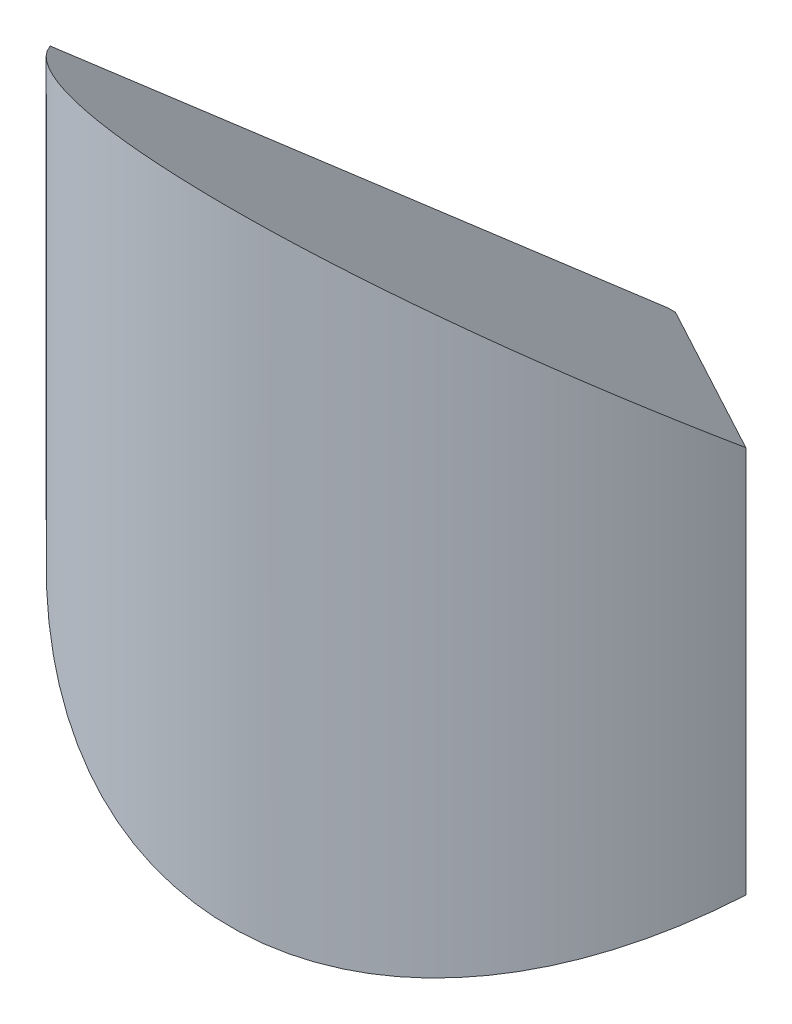
ISO-10303-21;
HEADER;
FILE_DESCRIPTION(('STEP AP214'),'2;1');
FILE_NAME('part.step','',(''),(''),'','','');
FILE_SCHEMA(('AUTOMOTIVE_DESIGN { 1 0 10303 214 1 1 1 1 }'));
ENDSEC;
DATA;
#1=APPLICATION_CONTEXT('core data for automotive mechanical design processes');
#2=APPLICATION_PROTOCOL_DEFINITION('international standard','automotive_design',2000,#1);
#3=PRODUCT_CONTEXT('',#1,'mechanical');
#4=PRODUCT('Part','Part','',(#3));
#5=PRODUCT_RELATED_PRODUCT_CATEGORY('part','',(#4));
#6=PRODUCT_DEFINITION_FORMATION('','',#4);
#7=PRODUCT_DEFINITION_CONTEXT('part definition',#1,'design');
#8=PRODUCT_DEFINITION('design','',#6,#7);
#9=PRODUCT_DEFINITION_SHAPE('','',#8);
#10=(LENGTH_UNIT() NAMED_UNIT(*) SI_UNIT(.MILLI.,.METRE.));
#11=(NAMED_UNIT(*) PLANE_ANGLE_UNIT() SI_UNIT($,.RADIAN.));
#12=(NAMED_UNIT(*) SI_UNIT($,.STERADIAN.) SOLID_ANGLE_UNIT());
#13=UNCERTAINTY_MEASURE_WITH_UNIT(LENGTH_MEASURE(1.E-05),#10,'distance_accuracy_value','');
#14=(GEOMETRIC_REPRESENTATION_CONTEXT(3) GLOBAL_UNCERTAINTY_ASSIGNED_CONTEXT((#13)) GLOBAL_UNIT_ASSIGNED_CONTEXT((#10,
#11,#12)) REPRESENTATION_CONTEXT('',''));
#15=CARTESIAN_POINT('',(0.,0.,0.));
#16=DIRECTION('',(0.,0.,1.));
#17=DIRECTION('',(1.,0.,0.));
#18=AXIS2_PLACEMENT_3D('',#15,#16,#17);
#19=CARTESIAN_POINT('',(-11.73912235279,0.07295042217277,4.45));
#20=DIRECTION('',(0.,0.,1.));
#21=DIRECTION('',(1.,0.,0.));
#22=AXIS2_PLACEMENT_3D('',#19,#20,#21);
#23=PLANE('',#22);
#24=DIRECTION('',(3.353287868579E-12,1.,-1.095758672662E-13));
#25=VECTOR('',#24,1.);
#26=CARTESIAN_POINT('',(-0.1309772388123,-0.07295042217522,4.449999999999));
#27=LINE('',#26,#25);
#28=CARTESIAN_POINT('',(-0.1309772388123,-0.07295042217522,4.449999999999));
#29=VERTEX_POINT('',#28);
#30=CARTESIAN_POINT('',(-0.1309772388118,0.07295042217549,4.449999999999));
#31=VERTEX_POINT('',#30);
#32=EDGE_CURVE('E11',#29,#31,#27,.T.);
#33=ORIENTED_EDGE('',*,*,#32,.T.);
#34=DIRECTION('',(-1.,0.,0.));
#35=VECTOR('',#34,1.);
#36=CARTESIAN_POINT('',(0.1309772388118,0.07295042217549,4.449999999999));
#37=LINE('',#36,#35);
#38=CARTESIAN_POINT('',(0.1309772388118,0.07295042217549,4.449999999999));
#39=VERTEX_POINT('',#38);
#40=EDGE_CURVE('E45',#39,#31,#37,.T.);
#41=ORIENTED_EDGE('',*,*,#40,.F.);
#42=DIRECTION('',(-3.341112772216E-12,1.,-1.095758672662E-13));
#43=VECTOR('',#42,1.);
#44=CARTESIAN_POINT('',(0.1309772388123,-0.07295042217522,4.449999999999));
#45=LINE('',#44,#43);
#46=CARTESIAN_POINT('',(0.1309772388123,-0.07295042217522,4.449999999999));
#47=VERTEX_POINT('',#46);
#48=EDGE_CURVE('E85',#47,#39,#45,.T.);
#49=ORIENTED_EDGE('',*,*,#48,.F.);
#50=DIRECTION('',(-1.,0.,0.));
#51=VECTOR('',#50,1.);
#52=CARTESIAN_POINT('',(0.1309772388123,-0.07295042217522,4.449999999999));
#53=LINE('',#52,#51);
#54=EDGE_CURVE('E80',#47,#29,#53,.T.);
#55=ORIENTED_EDGE('',*,*,#54,.T.);
#56=EDGE_LOOP('',(#33,#41,#49,#55));
#57=FACE_BOUND('',#56,.T.);
#58=ADVANCED_FACE('F17',(#57),#23,.F.);
#59=CARTESIAN_POINT('',(3.401071049766,0.,1.64048193186));
#60=DIRECTION('',(0.622514636637614,0.,0.782608156852418));
#61=DIRECTION('',(0.,-1.,0.));
#62=AXIS2_PLACEMENT_3D('',#59,#60,#61);
#63=PLANE('',#62);
#64=DIRECTION('',(0.717415840225579,0.399579261958889,-0.570658326501784));
#65=VECTOR('',#64,1.);
#66=CARTESIAN_POINT('',(-11.73912235279,-6.538341618299,13.68353554955));
#67=LINE('',#66,#65);
#68=CARTESIAN_POINT('',(-11.73912235279,-6.538341618298,13.68353554954));
#69=VERTEX_POINT('',#68);
#70=EDGE_CURVE('E96',#69,#29,#67,.T.);
#71=ORIENTED_EDGE('',*,*,#70,.F.);
#72=DIRECTION('',(0.,1.,0.));
#73=VECTOR('',#72,1.);
#74=CARTESIAN_POINT('',(-11.73912235279,-6.538341618299,13.68353554955));
#75=LINE('',#74,#73);
#76=CARTESIAN_POINT('',(-11.73912235279,6.538341618298,13.68353554955));
#77=VERTEX_POINT('',#76);
#78=EDGE_CURVE('E94',#69,#77,#75,.T.);
#79=ORIENTED_EDGE('',*,*,#78,.T.);
#80=DIRECTION('',(-0.717415840225567,0.399579261958782,0.570658326501874));
#81=VECTOR('',#80,1.);
#82=CARTESIAN_POINT('',(-0.1309772388118,0.07295042217549,4.449999999999));
#83=LINE('',#82,#81);
#84=EDGE_CURVE('E27',#31,#77,#83,.T.);
#85=ORIENTED_EDGE('',*,*,#84,.F.);
#86=ORIENTED_EDGE('',*,*,#32,.F.);
#87=EDGE_LOOP('',(#71,#79,#85,#86));
#88=FACE_BOUND('',#87,.T.);
#89=ADVANCED_FACE('F137',(#88),#63,.F.);
#90=CARTESIAN_POINT('',(-11.73912235279,10.50311307315,19.34581599998));
#91=DIRECTION('',(0.,-0.819152044289016,0.573576436351011));
#92=DIRECTION('',(-1.,0.,0.));
#93=AXIS2_PLACEMENT_3D('',#90,#91,#92);
#94=PLANE('',#93);
#95=DIRECTION('',(0.717415840225608,0.399579261958804,0.570658326501806));
#96=VECTOR('',#95,1.);
#97=CARTESIAN_POINT('',(0.1309772388118,0.07295042217549,4.449999999999));
#98=LINE('',#97,#96);
#99=CARTESIAN_POINT('',(11.73912235279,6.538341618299,13.68353554955));
#100=VERTEX_POINT('',#99);
#101=EDGE_CURVE('E99',#39,#100,#98,.T.);
#102=ORIENTED_EDGE('',*,*,#101,.F.);
#103=ORIENTED_EDGE('',*,*,#40,.T.);
#104=ORIENTED_EDGE('',*,*,#84,.T.);
#105=CARTESIAN_POINT('',(-11.73912235279,6.53834161830088,13.6835355495487));
#106=CARTESIAN_POINT('',(-10.4636321946505,7.66113203410889,15.2870464438742));
#107=CARTESIAN_POINT('',(-8.804341764591,8.50351724894573,16.4900972093526));
#108=CARTESIAN_POINT('',(-7.43265971198315,9.19989002350121,17.4846205992835));
#109=CARTESIAN_POINT('',(-5.86956117639373,9.66560996264396,18.1497376020704));
#110=CARTESIAN_POINT('',(-4.44952368071031,10.0887053472358,18.753980432237));
#111=CARTESIAN_POINT('',(-2.93478058819697,10.3001234049898,19.0559167100077));
#112=CARTESIAN_POINT('',(-1.4806718890143,10.5030785057352,19.3457666325954));
#113=CARTESIAN_POINT('',(0.,10.50311307315,19.34581599998));
#114=CARTESIAN_POINT('',(1.4796638324108,10.503147617031,19.3458653337548));
#115=CARTESIAN_POINT('',(2.93478058819696,10.3001234049898,19.0559167100077));
#116=CARTESIAN_POINT('',(4.4485596180985,10.0889143775848,18.7542789585134));
#117=CARTESIAN_POINT('',(5.86956117639375,9.66560996264396,18.1497376020704));
#118=CARTESIAN_POINT('',(7.43180827660165,9.20022968850832,17.4851056911864));
#119=CARTESIAN_POINT('',(8.804341764591,8.50351724894573,16.4900972093526));
#120=CARTESIAN_POINT('',(10.4633318375597,7.66139643290548,15.2874240444885));
#121=CARTESIAN_POINT('',(11.73912235279,6.53834161830088,13.6835355495487));
#122=B_SPLINE_CURVE_WITH_KNOTS('',2,(#105,#106,#107,#108,#109,#110,#111,#112,#113,#114,#115,
#116,#117,#118,#119,#120,#121),.UNSPECIFIED.,.F.,.F.,(3,2,2,2,2,2,2,2,3),(0.,0.125,0.25,0.375,
0.5,0.625,0.75,0.875,1.),.UNSPECIFIED.);
#123=EDGE_CURVE('E102',#77,#100,#122,.T.);
#124=ORIENTED_EDGE('',*,*,#123,.T.);
#125=EDGE_LOOP('',(#102,#103,#104,#124));
#126=FACE_BOUND('',#125,.T.);
#127=ADVANCED_FACE('F127',(#126),#94,.F.);
#128=CARTESIAN_POINT('',(-3.401071049766,0.,1.64048193186));
#129=DIRECTION('',(0.622514636637614,0.,-0.782608156852418));
#130=DIRECTION('',(0.,-1.,0.));
#131=AXIS2_PLACEMENT_3D('',#128,#129,#130);
#132=PLANE('',#131);
#133=ORIENTED_EDGE('',*,*,#48,.T.);
#134=ORIENTED_EDGE('',*,*,#101,.T.);
#135=DIRECTION('',(0.,-1.,0.));
#136=VECTOR('',#135,1.);
#137=CARTESIAN_POINT('',(11.73912235279,6.538341618298,13.68353554955));
#138=LINE('',#137,#136);
#139=CARTESIAN_POINT('',(11.73912235279,-6.538341618298,13.68353554954));
#140=VERTEX_POINT('',#139);
#141=EDGE_CURVE('E92',#100,#140,#138,.T.);
#142=ORIENTED_EDGE('',*,*,#141,.T.);
#143=DIRECTION('',(-0.717415840225579,0.399579261958889,-0.570658326501784));
#144=VECTOR('',#143,1.);
#145=CARTESIAN_POINT('',(11.73912235279,-6.538341618299,13.68353554955));
#146=LINE('',#145,#144);
#147=EDGE_CURVE('E73',#140,#47,#146,.T.);
#148=ORIENTED_EDGE('',*,*,#147,.T.);
#149=EDGE_LOOP('',(#133,#134,#142,#148));
#150=FACE_BOUND('',#149,.T.);
#151=ADVANCED_FACE('F19',(#150),#132,.T.);
#152=CARTESIAN_POINT('',(-11.73912235279,-10.50311307315,19.34581599998));
#153=DIRECTION('',(0.,0.819152044289016,0.573576436351011));
#154=DIRECTION('',(1.,0.,0.));
#155=AXIS2_PLACEMENT_3D('',#152,#153,#154);
#156=PLANE('',#155);
#157=ORIENTED_EDGE('',*,*,#70,.T.);
#158=ORIENTED_EDGE('',*,*,#54,.F.);
#159=ORIENTED_EDGE('',*,*,#147,.F.);
#160=CARTESIAN_POINT('',(11.73912235279,-6.53834161829586,13.6835355495415));
#161=CARTESIAN_POINT('',(10.4636321947328,-7.66113203406665,15.2870464438139));
#162=CARTESIAN_POINT('',(8.80434176459115,-8.50351724894573,16.4900972093526));
#163=CARTESIAN_POINT('',(7.4326597119851,-9.19989002350076,17.4846205992829));
#164=CARTESIAN_POINT('',(5.86956117639405,-9.66560996264396,18.1497376020704));
#165=CARTESIAN_POINT('',(4.44952368070665,-10.0887053472369,18.7539804322387));
#166=CARTESIAN_POINT('',(2.93478058819696,-10.3001234049898,19.0559167100077));
#167=CARTESIAN_POINT('',(1.4806718889807,-10.5030785057392,19.3457666326012));
#168=CARTESIAN_POINT('',(0.,-10.50311307315,19.34581599998));
#169=CARTESIAN_POINT('',(-1.47966383244136,-10.5031476170269,19.345865333749));
#170=CARTESIAN_POINT('',(-2.93478058819697,-10.3001234049898,19.0559167100077));
#171=CARTESIAN_POINT('',(-4.44855961809695,-10.0889143775849,18.7542789585134));
#172=CARTESIAN_POINT('',(-5.86956117639407,-9.66560996264396,18.1497376020704));
#173=CARTESIAN_POINT('',(-7.43180827654475,-9.20022968852597,17.4851056912116));
#174=CARTESIAN_POINT('',(-8.80434176459117,-8.50351724894573,16.4900972093526));
#175=CARTESIAN_POINT('',(-10.4633318376038,-7.66139643289688,15.2874240444762));
#176=CARTESIAN_POINT('',(-11.73912235279,-6.53834161829586,13.6835355495415));
#177=B_SPLINE_CURVE_WITH_KNOTS('',2,(#160,#161,#162,#163,#164,#165,#166,#167,#168,#169,#170,
#171,#172,#173,#174,#175,#176),.UNSPECIFIED.,.F.,.F.,(3,2,2,2,2,2,2,2,3),(0.,0.125,0.25,0.375,
0.5,0.625,0.75,0.875,1.),.UNSPECIFIED.);
#178=EDGE_CURVE('E77',#140,#69,#177,.T.);
#179=ORIENTED_EDGE('',*,*,#178,.T.);
#180=EDGE_LOOP('',(#157,#158,#159,#179));
#181=FACE_BOUND('',#180,.T.);
#182=ADVANCED_FACE('F76',(#181),#156,.F.);
#183=CARTESIAN_POINT('',(0.,0.,4.345815999983));
#184=DIRECTION('',(0.,-1.,0.));
#185=DIRECTION('',(0.,0.,-1.));
#186=AXIS2_PLACEMENT_3D('',#183,#184,#185);
#187=CYLINDRICAL_SURFACE('',#186,15.);
#188=ORIENTED_EDGE('',*,*,#141,.F.);
#189=ORIENTED_EDGE('',*,*,#123,.F.);
#190=ORIENTED_EDGE('',*,*,#78,.F.);
#191=ORIENTED_EDGE('',*,*,#178,.F.);
#192=EDGE_LOOP('',(#188,#189,#190,#191));
#193=FACE_BOUND('',#192,.T.);
#194=ADVANCED_FACE('F90',(#193),#187,.T.);
#195=CLOSED_SHELL('',(#58,#89,#127,#151,#182,#194));
#196=MANIFOLD_SOLID_BREP('B1',#195);
#197=ADVANCED_BREP_SHAPE_REPRESENTATION('',(#18,#196),#14);
#198=SHAPE_DEFINITION_REPRESENTATION(#9,#197);
ENDSEC;
END-ISO-10303-21;
